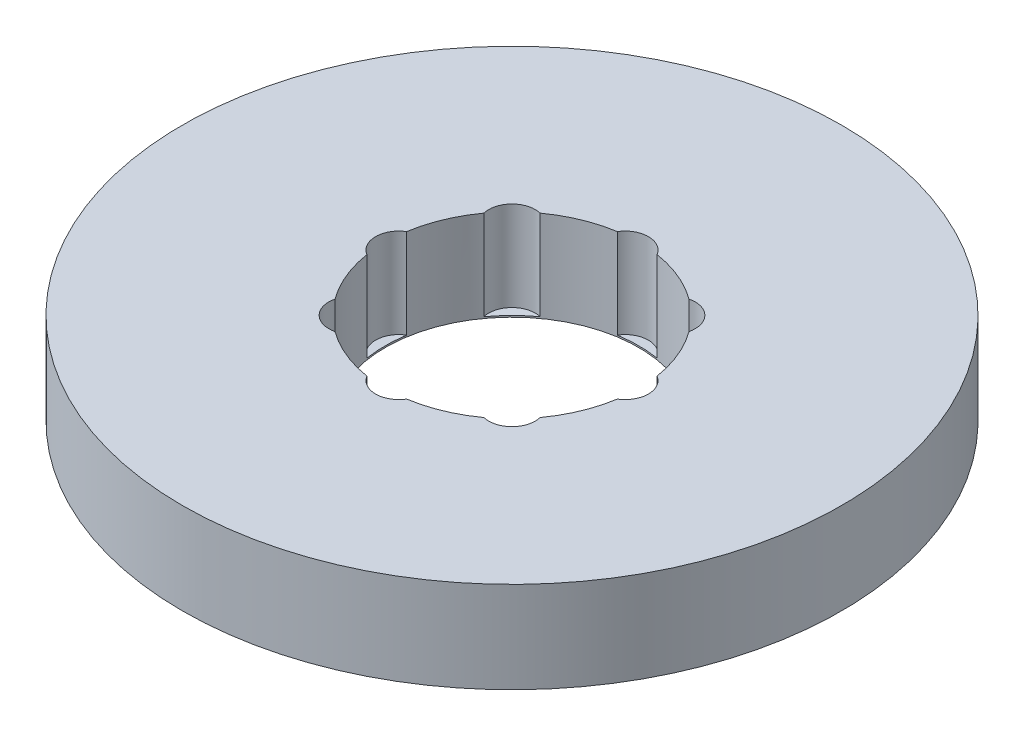
ISO-10303-21;
HEADER;
FILE_DESCRIPTION(('STEP AP214'),'2;1');
FILE_NAME('part.step','',(''),(''),'','','');
FILE_SCHEMA(('AUTOMOTIVE_DESIGN { 1 0 10303 214 1 1 1 1 }'));
ENDSEC;
DATA;
#1=APPLICATION_CONTEXT('core data for automotive mechanical design processes');
#2=APPLICATION_PROTOCOL_DEFINITION('international standard','automotive_design',2000,#1);
#3=PRODUCT_CONTEXT('',#1,'mechanical');
#4=PRODUCT('Part','Part','',(#3));
#5=PRODUCT_RELATED_PRODUCT_CATEGORY('part','',(#4));
#6=PRODUCT_DEFINITION_FORMATION('','',#4);
#7=PRODUCT_DEFINITION_CONTEXT('part definition',#1,'design');
#8=PRODUCT_DEFINITION('design','',#6,#7);
#9=PRODUCT_DEFINITION_SHAPE('','',#8);
#10=(LENGTH_UNIT() NAMED_UNIT(*) SI_UNIT(.MILLI.,.METRE.));
#11=(NAMED_UNIT(*) PLANE_ANGLE_UNIT() SI_UNIT($,.RADIAN.));
#12=(NAMED_UNIT(*) SI_UNIT($,.STERADIAN.) SOLID_ANGLE_UNIT());
#13=UNCERTAINTY_MEASURE_WITH_UNIT(LENGTH_MEASURE(1.E-05),#10,'distance_accuracy_value','');
#14=(GEOMETRIC_REPRESENTATION_CONTEXT(3) GLOBAL_UNCERTAINTY_ASSIGNED_CONTEXT((#13)) GLOBAL_UNIT_ASSIGNED_CONTEXT((#10,
#11,#12)) REPRESENTATION_CONTEXT('',''));
#15=CARTESIAN_POINT('',(0.,0.,0.));
#16=DIRECTION('',(0.,0.,1.));
#17=DIRECTION('',(1.,0.,0.));
#18=AXIS2_PLACEMENT_3D('',#15,#16,#17);
#19=CARTESIAN_POINT('',(0.,9.,0.));
#20=DIRECTION('',(0.,-1.,0.));
#21=DIRECTION('',(0.,0.,-1.));
#22=AXIS2_PLACEMENT_3D('',#19,#20,#21);
#23=CYLINDRICAL_SURFACE('',#22,32.5);
#24=CARTESIAN_POINT('',(0.,9.,0.));
#25=DIRECTION('',(0.,1.,0.));
#26=DIRECTION('',(0.,0.,1.));
#27=AXIS2_PLACEMENT_3D('',#24,#25,#26);
#28=CIRCLE('',#27,32.5);
#29=CARTESIAN_POINT('',(0.,9.,32.5));
#30=VERTEX_POINT('',#29);
#31=EDGE_CURVE('E183',#30,#30,#28,.T.);
#32=ORIENTED_EDGE('',*,*,#31,.F.);
#33=EDGE_LOOP('',(#32));
#34=FACE_BOUND('',#33,.T.);
#35=CARTESIAN_POINT('',(0.,0.,0.));
#36=DIRECTION('',(0.,1.,0.));
#37=DIRECTION('',(0.,0.,1.));
#38=AXIS2_PLACEMENT_3D('',#35,#36,#37);
#39=CIRCLE('',#38,32.5);
#40=CARTESIAN_POINT('',(0.,0.,32.5));
#41=VERTEX_POINT('',#40);
#42=EDGE_CURVE('E182',#41,#41,#39,.T.);
#43=ORIENTED_EDGE('',*,*,#42,.T.);
#44=EDGE_LOOP('',(#43));
#45=FACE_BOUND('',#44,.T.);
#46=ADVANCED_FACE('F39',(#34,#45),#23,.T.);
#47=CARTESIAN_POINT('',(0.,9.,0.));
#48=DIRECTION('',(0.,1.,0.));
#49=DIRECTION('',(0.,0.,1.));
#50=AXIS2_PLACEMENT_3D('',#47,#48,#49);
#51=PLANE('',#50);
#52=CARTESIAN_POINT('',(0.,9.,11.1549653682034));
#53=DIRECTION('',(0.,1.,0.));
#54=DIRECTION('',(1.,0.,0.));
#55=AXIS2_PLACEMENT_3D('',#52,#53,#54);
#56=CIRCLE('',#55,2.29332355771924);
#57=CARTESIAN_POINT('',(-1.9601825579332,9.,12.3453507175606));
#58=VERTEX_POINT('',#57);
#59=CARTESIAN_POINT('',(1.96018255793328,9.,12.3453507175606));
#60=VERTEX_POINT('',#59);
#61=EDGE_CURVE('E256',#58,#60,#56,.T.);
#62=ORIENTED_EDGE('',*,*,#61,.F.);
#63=CARTESIAN_POINT('',(0.,9.,0.));
#64=DIRECTION('',(0.,1.,0.));
#65=DIRECTION('',(0.,0.,1.));
#66=AXIS2_PLACEMENT_3D('',#63,#64,#65);
#67=CIRCLE('',#66,12.5);
#68=CARTESIAN_POINT('',(-7.34342282943511,9.,10.1155395875915));
#69=VERTEX_POINT('',#68);
#70=EDGE_CURVE('E175',#69,#58,#67,.T.);
#71=ORIENTED_EDGE('',*,*,#70,.F.);
#72=CARTESIAN_POINT('',(-7.88775165575769,9.,7.88775165575772));
#73=DIRECTION('',(0.,1.,0.));
#74=DIRECTION('',(0.707106781186549,0.,0.707106781186546));
#75=AXIS2_PLACEMENT_3D('',#72,#73,#74);
#76=CIRCLE('',#75,2.29332355771924);
#77=CARTESIAN_POINT('',(-10.1155395875915,9.,7.34342282943515));
#78=VERTEX_POINT('',#77);
#79=EDGE_CURVE('E152',#78,#69,#76,.T.);
#80=ORIENTED_EDGE('',*,*,#79,.F.);
#81=CARTESIAN_POINT('',(-12.3453507175606,9.,1.96018255793324));
#82=VERTEX_POINT('',#81);
#83=EDGE_CURVE('E168',#82,#78,#67,.T.);
#84=ORIENTED_EDGE('',*,*,#83,.F.);
#85=CARTESIAN_POINT('',(-11.1549653682034,9.,0.));
#86=DIRECTION('',(0.,1.,0.));
#87=DIRECTION('',(0.,0.,1.));
#88=AXIS2_PLACEMENT_3D('',#85,#86,#87);
#89=CIRCLE('',#88,2.29332355771924);
#90=CARTESIAN_POINT('',(-12.3453507175606,9.,-1.96018255793324));
#91=VERTEX_POINT('',#90);
#92=EDGE_CURVE('E205',#91,#82,#89,.T.);
#93=ORIENTED_EDGE('',*,*,#92,.F.);
#94=CARTESIAN_POINT('',(-10.1155395875916,9.,-7.34342282943501));
#95=VERTEX_POINT('',#94);
#96=EDGE_CURVE('E181',#95,#91,#67,.T.);
#97=ORIENTED_EDGE('',*,*,#96,.F.);
#98=CARTESIAN_POINT('',(-7.8877516557578,9.,-7.88775165575761));
#99=DIRECTION('',(0.,1.,0.));
#100=DIRECTION('',(-0.707106781186539,0.,0.707106781186556));
#101=AXIS2_PLACEMENT_3D('',#98,#99,#100);
#102=CIRCLE('',#101,2.29332355771924);
#103=CARTESIAN_POINT('',(-7.34342282943525,9.,-10.1155395875914));
#104=VERTEX_POINT('',#103);
#105=EDGE_CURVE('E453',#104,#95,#102,.T.);
#106=ORIENTED_EDGE('',*,*,#105,.F.);
#107=CARTESIAN_POINT('',(-1.96018255793337,9.,-12.3453507175606));
#108=VERTEX_POINT('',#107);
#109=EDGE_CURVE('E189',#108,#104,#67,.T.);
#110=ORIENTED_EDGE('',*,*,#109,.F.);
#111=CARTESIAN_POINT('',(-1.16842060255571E-13,9.,-11.1549653682034));
#112=DIRECTION('',(0.,1.,0.));
#113=DIRECTION('',(-1.,0.,0.));
#114=AXIS2_PLACEMENT_3D('',#111,#112,#113);
#115=CIRCLE('',#114,2.29332355771924);
#116=CARTESIAN_POINT('',(1.96018255793311,9.,-12.3453507175606));
#117=VERTEX_POINT('',#116);
#118=EDGE_CURVE('E462',#117,#108,#115,.T.);
#119=ORIENTED_EDGE('',*,*,#118,.F.);
#120=CARTESIAN_POINT('',(7.34342282943504,9.,-10.1155395875916));
#121=VERTEX_POINT('',#120);
#122=EDGE_CURVE('E197',#121,#117,#67,.T.);
#123=ORIENTED_EDGE('',*,*,#122,.F.);
#124=CARTESIAN_POINT('',(7.88775165575764,9.,-7.88775165575778));
#125=DIRECTION('',(0.,1.,0.));
#126=DIRECTION('',(-0.707106781186554,0.,-0.707106781186541));
#127=AXIS2_PLACEMENT_3D('',#124,#125,#126);
#128=CIRCLE('',#127,2.29332355771924);
#129=CARTESIAN_POINT('',(10.1155395875914,9.,-7.34342282943522));
#130=VERTEX_POINT('',#129);
#131=EDGE_CURVE('E470',#130,#121,#128,.T.);
#132=ORIENTED_EDGE('',*,*,#131,.F.);
#133=CARTESIAN_POINT('',(12.3453507175606,9.,-1.96018255793324));
#134=VERTEX_POINT('',#133);
#135=EDGE_CURVE('E489',#134,#130,#67,.T.);
#136=ORIENTED_EDGE('',*,*,#135,.F.);
#137=CARTESIAN_POINT('',(11.1549653682034,9.,0.));
#138=DIRECTION('',(0.,1.,0.));
#139=DIRECTION('',(0.,0.,-1.));
#140=AXIS2_PLACEMENT_3D('',#137,#138,#139);
#141=CIRCLE('',#140,2.29332355771924);
#142=CARTESIAN_POINT('',(12.3453507175606,9.,1.96018255793324));
#143=VERTEX_POINT('',#142);
#144=EDGE_CURVE('E476',#143,#134,#141,.T.);
#145=ORIENTED_EDGE('',*,*,#144,.F.);
#146=CARTESIAN_POINT('',(10.1155395875915,9.,7.34342282943508));
#147=VERTEX_POINT('',#146);
#148=EDGE_CURVE('E491',#147,#143,#67,.T.);
#149=ORIENTED_EDGE('',*,*,#148,.F.);
#150=CARTESIAN_POINT('',(7.88775165575775,9.,7.88775165575767));
#151=DIRECTION('',(0.,1.,0.));
#152=DIRECTION('',(0.707106781186544,0.,-0.707106781186551));
#153=AXIS2_PLACEMENT_3D('',#150,#151,#152);
#154=CIRCLE('',#153,2.29332355771924);
#155=CARTESIAN_POINT('',(7.34342282943519,9.,10.1155395875915));
#156=VERTEX_POINT('',#155);
#157=EDGE_CURVE('E475',#156,#147,#154,.T.);
#158=ORIENTED_EDGE('',*,*,#157,.F.);
#159=EDGE_CURVE('E190',#60,#156,#67,.T.);
#160=ORIENTED_EDGE('',*,*,#159,.F.);
#161=EDGE_LOOP('',(#62,#71,#80,#84,#93,#97,#106,#110,#119,#123,#132,#136,#145,#149,#158,#160));
#162=FACE_BOUND('',#161,.T.);
#163=ORIENTED_EDGE('',*,*,#31,.T.);
#164=EDGE_LOOP('',(#163));
#165=FACE_BOUND('',#164,.T.);
#166=ADVANCED_FACE('F170',(#162,#165),#51,.T.);
#167=CARTESIAN_POINT('',(0.,0.,0.));
#168=DIRECTION('',(0.,1.,0.));
#169=DIRECTION('',(0.,0.,1.));
#170=AXIS2_PLACEMENT_3D('',#167,#168,#169);
#171=PLANE('',#170);
#172=CARTESIAN_POINT('',(0.,0.,0.));
#173=DIRECTION('',(0.,1.,0.));
#174=DIRECTION('',(0.,0.,1.));
#175=AXIS2_PLACEMENT_3D('',#172,#173,#174);
#176=CIRCLE('',#175,12.5);
#177=CARTESIAN_POINT('',(0.,0.,12.5));
#178=VERTEX_POINT('',#177);
#179=EDGE_CURVE('E191',#178,#178,#176,.T.);
#180=ORIENTED_EDGE('',*,*,#179,.T.);
#181=EDGE_LOOP('',(#180));
#182=FACE_BOUND('',#181,.T.);
#183=ORIENTED_EDGE('',*,*,#42,.F.);
#184=EDGE_LOOP('',(#183));
#185=FACE_BOUND('',#184,.T.);
#186=ADVANCED_FACE('F277',(#182,#185),#171,.F.);
#187=CARTESIAN_POINT('',(0.,9.,0.));
#188=DIRECTION('',(0.,-1.,0.));
#189=DIRECTION('',(0.,0.,-1.));
#190=AXIS2_PLACEMENT_3D('',#187,#188,#189);
#191=CYLINDRICAL_SURFACE('',#190,12.5);
#192=DIRECTION('',(0.,1.,0.));
#193=VECTOR('',#192,1.);
#194=CARTESIAN_POINT('',(-1.9601825579332,4.57739685609202,12.3453507175606));
#195=LINE('',#194,#193);
#196=CARTESIAN_POINT('',(-1.9601825579332,0.154793712184052,12.3453507175606));
#197=VERTEX_POINT('',#196);
#198=EDGE_CURVE('E11',#197,#58,#195,.T.);
#199=ORIENTED_EDGE('',*,*,#198,.F.);
#200=CARTESIAN_POINT('',(0.,0.154793712184052,0.));
#201=DIRECTION('',(0.,1.,0.));
#202=DIRECTION('',(0.,0.,1.));
#203=AXIS2_PLACEMENT_3D('',#200,#201,#202);
#204=CIRCLE('',#203,12.5);
#205=CARTESIAN_POINT('',(1.96018255793328,0.154793712184052,12.3453507175606));
#206=VERTEX_POINT('',#205);
#207=EDGE_CURVE('E251',#197,#206,#204,.T.);
#208=ORIENTED_EDGE('',*,*,#207,.T.);
#209=DIRECTION('',(0.,1.,0.));
#210=VECTOR('',#209,1.);
#211=CARTESIAN_POINT('',(1.96018255793328,4.57739685609202,12.3453507175606));
#212=LINE('',#211,#210);
#213=EDGE_CURVE('E46',#60,#206,#212,.F.);
#214=ORIENTED_EDGE('',*,*,#213,.F.);
#215=ORIENTED_EDGE('',*,*,#159,.T.);
#216=DIRECTION('',(0.,1.,0.));
#217=VECTOR('',#216,1.);
#218=CARTESIAN_POINT('',(7.34342282943518,4.57739685609202,10.1155395875915));
#219=LINE('',#218,#217);
#220=CARTESIAN_POINT('',(7.34342282943519,0.154793712184052,10.1155395875915));
#221=VERTEX_POINT('',#220);
#222=EDGE_CURVE('E253',#221,#156,#219,.T.);
#223=ORIENTED_EDGE('',*,*,#222,.F.);
#224=CARTESIAN_POINT('',(0.,0.154793712184052,0.));
#225=DIRECTION('',(0.,1.,0.));
#226=DIRECTION('',(0.,0.,1.));
#227=AXIS2_PLACEMENT_3D('',#224,#225,#226);
#228=CIRCLE('',#227,12.5);
#229=CARTESIAN_POINT('',(10.1155395875915,0.154793712184052,7.34342282943508));
#230=VERTEX_POINT('',#229);
#231=EDGE_CURVE('E246',#221,#230,#228,.T.);
#232=ORIENTED_EDGE('',*,*,#231,.T.);
#233=DIRECTION('',(0.,1.,0.));
#234=VECTOR('',#233,1.);
#235=CARTESIAN_POINT('',(10.1155395875915,4.57739685609202,7.34342282943508));
#236=LINE('',#235,#234);
#237=EDGE_CURVE('E248',#147,#230,#236,.F.);
#238=ORIENTED_EDGE('',*,*,#237,.F.);
#239=ORIENTED_EDGE('',*,*,#148,.T.);
#240=DIRECTION('',(0.,1.,0.));
#241=VECTOR('',#240,1.);
#242=CARTESIAN_POINT('',(12.3453507175606,4.57739685609202,1.96018255793324));
#243=LINE('',#242,#241);
#244=CARTESIAN_POINT('',(12.3453507175606,0.154793712184052,1.96018255793324));
#245=VERTEX_POINT('',#244);
#246=EDGE_CURVE('E243',#245,#143,#243,.T.);
#247=ORIENTED_EDGE('',*,*,#246,.F.);
#248=CARTESIAN_POINT('',(0.,0.154793712184052,0.));
#249=DIRECTION('',(0.,1.,0.));
#250=DIRECTION('',(0.,0.,1.));
#251=AXIS2_PLACEMENT_3D('',#248,#249,#250);
#252=CIRCLE('',#251,12.5);
#253=CARTESIAN_POINT('',(12.3453507175606,0.154793712184052,-1.96018255793324));
#254=VERTEX_POINT('',#253);
#255=EDGE_CURVE('E236',#245,#254,#252,.T.);
#256=ORIENTED_EDGE('',*,*,#255,.T.);
#257=DIRECTION('',(0.,1.,0.));
#258=VECTOR('',#257,1.);
#259=CARTESIAN_POINT('',(12.3453507175606,4.57739685609202,-1.96018255793324));
#260=LINE('',#259,#258);
#261=EDGE_CURVE('E241',#134,#254,#260,.F.);
#262=ORIENTED_EDGE('',*,*,#261,.F.);
#263=ORIENTED_EDGE('',*,*,#135,.T.);
#264=DIRECTION('',(0.,1.,0.));
#265=VECTOR('',#264,1.);
#266=CARTESIAN_POINT('',(10.1155395875914,4.57739685609202,-7.34342282943522));
#267=LINE('',#266,#265);
#268=CARTESIAN_POINT('',(10.1155395875914,0.154793712184052,-7.34342282943522));
#269=VERTEX_POINT('',#268);
#270=EDGE_CURVE('E237',#269,#130,#267,.T.);
#271=ORIENTED_EDGE('',*,*,#270,.F.);
#272=CARTESIAN_POINT('',(0.,0.154793712184052,0.));
#273=DIRECTION('',(0.,1.,0.));
#274=DIRECTION('',(0.,0.,1.));
#275=AXIS2_PLACEMENT_3D('',#272,#273,#274);
#276=CIRCLE('',#275,12.5);
#277=CARTESIAN_POINT('',(7.34342282943504,0.154793712184052,-10.1155395875916));
#278=VERTEX_POINT('',#277);
#279=EDGE_CURVE('E229',#269,#278,#276,.T.);
#280=ORIENTED_EDGE('',*,*,#279,.T.);
#281=DIRECTION('',(0.,1.,0.));
#282=VECTOR('',#281,1.);
#283=CARTESIAN_POINT('',(7.34342282943504,4.57739685609202,-10.1155395875916));
#284=LINE('',#283,#282);
#285=EDGE_CURVE('E232',#121,#278,#284,.F.);
#286=ORIENTED_EDGE('',*,*,#285,.F.);
#287=ORIENTED_EDGE('',*,*,#122,.T.);
#288=DIRECTION('',(0.,1.,0.));
#289=VECTOR('',#288,1.);
#290=CARTESIAN_POINT('',(1.96018255793311,4.57739685609202,-12.3453507175606));
#291=LINE('',#290,#289);
#292=CARTESIAN_POINT('',(1.96018255793311,0.154793712184052,-12.3453507175606));
#293=VERTEX_POINT('',#292);
#294=EDGE_CURVE('E227',#293,#117,#291,.T.);
#295=ORIENTED_EDGE('',*,*,#294,.F.);
#296=CARTESIAN_POINT('',(0.,0.154793712184052,0.));
#297=DIRECTION('',(0.,1.,0.));
#298=DIRECTION('',(0.,0.,1.));
#299=AXIS2_PLACEMENT_3D('',#296,#297,#298);
#300=CIRCLE('',#299,12.5);
#301=CARTESIAN_POINT('',(-1.96018255793337,0.154793712184052,-12.3453507175606));
#302=VERTEX_POINT('',#301);
#303=EDGE_CURVE('E225',#293,#302,#300,.T.);
#304=ORIENTED_EDGE('',*,*,#303,.T.);
#305=DIRECTION('',(0.,1.,0.));
#306=VECTOR('',#305,1.);
#307=CARTESIAN_POINT('',(-1.96018255793337,4.57739685609202,-12.3453507175606));
#308=LINE('',#307,#306);
#309=EDGE_CURVE('E223',#108,#302,#308,.F.);
#310=ORIENTED_EDGE('',*,*,#309,.F.);
#311=ORIENTED_EDGE('',*,*,#109,.T.);
#312=DIRECTION('',(0.,1.,0.));
#313=VECTOR('',#312,1.);
#314=CARTESIAN_POINT('',(-7.34342282943525,4.57739685609202,-10.1155395875914));
#315=LINE('',#314,#313);
#316=CARTESIAN_POINT('',(-7.34342282943525,0.154793712184052,-10.1155395875914));
#317=VERTEX_POINT('',#316);
#318=EDGE_CURVE('E219',#317,#104,#315,.T.);
#319=ORIENTED_EDGE('',*,*,#318,.F.);
#320=CARTESIAN_POINT('',(0.,0.154793712184052,0.));
#321=DIRECTION('',(0.,1.,0.));
#322=DIRECTION('',(0.,0.,1.));
#323=AXIS2_PLACEMENT_3D('',#320,#321,#322);
#324=CIRCLE('',#323,12.5);
#325=CARTESIAN_POINT('',(-10.1155395875916,0.154793712184052,-7.34342282943501));
#326=VERTEX_POINT('',#325);
#327=EDGE_CURVE('E159',#317,#326,#324,.T.);
#328=ORIENTED_EDGE('',*,*,#327,.T.);
#329=DIRECTION('',(0.,1.,0.));
#330=VECTOR('',#329,1.);
#331=CARTESIAN_POINT('',(-10.1155395875916,4.57739685609202,-7.34342282943501));
#332=LINE('',#331,#330);
#333=EDGE_CURVE('E220',#95,#326,#332,.F.);
#334=ORIENTED_EDGE('',*,*,#333,.F.);
#335=ORIENTED_EDGE('',*,*,#96,.T.);
#336=DIRECTION('',(0.,1.,0.));
#337=VECTOR('',#336,1.);
#338=CARTESIAN_POINT('',(-12.3453507175606,4.57739685609202,-1.96018255793324));
#339=LINE('',#338,#337);
#340=CARTESIAN_POINT('',(-12.3453507175606,0.154793712184052,-1.96018255793324));
#341=VERTEX_POINT('',#340);
#342=EDGE_CURVE('E209',#341,#91,#339,.T.);
#343=ORIENTED_EDGE('',*,*,#342,.F.);
#344=CARTESIAN_POINT('',(0.,0.154793712184052,0.));
#345=DIRECTION('',(0.,1.,0.));
#346=DIRECTION('',(0.,0.,1.));
#347=AXIS2_PLACEMENT_3D('',#344,#345,#346);
#348=CIRCLE('',#347,12.5);
#349=CARTESIAN_POINT('',(-12.3453507175606,0.154793712184052,1.96018255793324));
#350=VERTEX_POINT('',#349);
#351=EDGE_CURVE('E206',#341,#350,#348,.T.);
#352=ORIENTED_EDGE('',*,*,#351,.T.);
#353=DIRECTION('',(0.,1.,0.));
#354=VECTOR('',#353,1.);
#355=CARTESIAN_POINT('',(-12.3453507175606,4.57739685609202,1.96018255793324));
#356=LINE('',#355,#354);
#357=EDGE_CURVE('E179',#82,#350,#356,.F.);
#358=ORIENTED_EDGE('',*,*,#357,.F.);
#359=ORIENTED_EDGE('',*,*,#83,.T.);
#360=DIRECTION('',(0.,1.,0.));
#361=VECTOR('',#360,1.);
#362=CARTESIAN_POINT('',(-10.1155395875915,4.57739685609202,7.34342282943515));
#363=LINE('',#362,#361);
#364=CARTESIAN_POINT('',(-10.1155395875915,0.154793712184052,7.34342282943515));
#365=VERTEX_POINT('',#364);
#366=EDGE_CURVE('E147',#365,#78,#363,.T.);
#367=ORIENTED_EDGE('',*,*,#366,.F.);
#368=CARTESIAN_POINT('',(0.,0.154793712184052,0.));
#369=DIRECTION('',(0.,1.,0.));
#370=DIRECTION('',(0.,0.,1.));
#371=AXIS2_PLACEMENT_3D('',#368,#369,#370);
#372=CIRCLE('',#371,12.5);
#373=CARTESIAN_POINT('',(-7.34342282943511,0.154793712184052,10.1155395875915));
#374=VERTEX_POINT('',#373);
#375=EDGE_CURVE('E215',#365,#374,#372,.T.);
#376=ORIENTED_EDGE('',*,*,#375,.T.);
#377=DIRECTION('',(0.,1.,0.));
#378=VECTOR('',#377,1.);
#379=CARTESIAN_POINT('',(-7.34342282943511,4.57739685609202,10.1155395875915));
#380=LINE('',#379,#378);
#381=EDGE_CURVE('E161',#69,#374,#380,.F.);
#382=ORIENTED_EDGE('',*,*,#381,.F.);
#383=ORIENTED_EDGE('',*,*,#70,.T.);
#384=EDGE_LOOP('',(#199,#208,#214,#215,#223,#232,#238,#239,#247,#256,#262,#263,#271,#280,#286,
#287,#295,#304,#310,#311,#319,#328,#334,#335,#343,#352,#358,#359,#367,#376,#382,#383));
#385=FACE_BOUND('',#384,.T.);
#386=ORIENTED_EDGE('',*,*,#179,.F.);
#387=EDGE_LOOP('',(#386));
#388=FACE_BOUND('',#387,.T.);
#389=ADVANCED_FACE('F176',(#385,#388),#191,.F.);
#390=CARTESIAN_POINT('',(-11.1549653682034,0.154793712184052,0.));
#391=DIRECTION('',(0.,1.,0.));
#392=DIRECTION('',(0.,0.,1.));
#393=AXIS2_PLACEMENT_3D('',#390,#391,#392);
#394=CYLINDRICAL_SURFACE('',#393,2.29332355771924);
#395=ORIENTED_EDGE('',*,*,#342,.T.);
#396=ORIENTED_EDGE('',*,*,#92,.T.);
#397=ORIENTED_EDGE('',*,*,#357,.T.);
#398=CARTESIAN_POINT('',(-11.1549653682034,0.154793712184052,0.));
#399=DIRECTION('',(0.,1.,0.));
#400=DIRECTION('',(0.,0.,1.));
#401=AXIS2_PLACEMENT_3D('',#398,#399,#400);
#402=CIRCLE('',#401,2.29332355771924);
#403=EDGE_CURVE('E200',#341,#350,#402,.T.);
#404=ORIENTED_EDGE('',*,*,#403,.F.);
#405=EDGE_LOOP('',(#395,#396,#397,#404));
#406=FACE_BOUND('',#405,.T.);
#407=ADVANCED_FACE('F286',(#406),#394,.F.);
#408=CARTESIAN_POINT('',(-11.1549653682034,0.154793712184052,0.));
#409=DIRECTION('',(0.,1.,0.));
#410=DIRECTION('',(0.,0.,1.));
#411=AXIS2_PLACEMENT_3D('',#408,#409,#410);
#412=PLANE('',#411);
#413=ORIENTED_EDGE('',*,*,#403,.T.);
#414=ORIENTED_EDGE('',*,*,#351,.F.);
#415=EDGE_LOOP('',(#413,#414));
#416=FACE_BOUND('',#415,.T.);
#417=ADVANCED_FACE('F289',(#416),#412,.T.);
#418=CARTESIAN_POINT('',(-7.88775165575769,0.154793712184052,7.88775165575772));
#419=DIRECTION('',(0.,1.,0.));
#420=DIRECTION('',(0.,0.,1.));
#421=AXIS2_PLACEMENT_3D('',#418,#419,#420);
#422=CYLINDRICAL_SURFACE('',#421,2.29332355771924);
#423=ORIENTED_EDGE('',*,*,#366,.T.);
#424=ORIENTED_EDGE('',*,*,#79,.T.);
#425=ORIENTED_EDGE('',*,*,#381,.T.);
#426=CARTESIAN_POINT('',(-7.88775165575769,0.154793712184052,7.88775165575772));
#427=DIRECTION('',(0.,1.,0.));
#428=DIRECTION('',(0.707106781186549,0.,0.707106781186546));
#429=AXIS2_PLACEMENT_3D('',#426,#427,#428);
#430=CIRCLE('',#429,2.29332355771924);
#431=EDGE_CURVE('E156',#365,#374,#430,.T.);
#432=ORIENTED_EDGE('',*,*,#431,.F.);
#433=EDGE_LOOP('',(#423,#424,#425,#432));
#434=FACE_BOUND('',#433,.T.);
#435=ADVANCED_FACE('F155',(#434),#422,.F.);
#436=CARTESIAN_POINT('',(-7.88775165575769,0.154793712184052,7.88775165575772));
#437=DIRECTION('',(0.,1.,0.));
#438=DIRECTION('',(0.707106781186549,0.,0.707106781186546));
#439=AXIS2_PLACEMENT_3D('',#436,#437,#438);
#440=PLANE('',#439);
#441=ORIENTED_EDGE('',*,*,#431,.T.);
#442=ORIENTED_EDGE('',*,*,#375,.F.);
#443=EDGE_LOOP('',(#441,#442));
#444=FACE_BOUND('',#443,.T.);
#445=ADVANCED_FACE('F300',(#444),#440,.T.);
#446=CARTESIAN_POINT('',(-7.8877516557578,0.154793712184052,-7.88775165575761));
#447=DIRECTION('',(0.,1.,0.));
#448=DIRECTION('',(0.,0.,1.));
#449=AXIS2_PLACEMENT_3D('',#446,#447,#448);
#450=CYLINDRICAL_SURFACE('',#449,2.29332355771924);
#451=ORIENTED_EDGE('',*,*,#318,.T.);
#452=ORIENTED_EDGE('',*,*,#105,.T.);
#453=ORIENTED_EDGE('',*,*,#333,.T.);
#454=CARTESIAN_POINT('',(-7.8877516557578,0.154793712184052,-7.88775165575761));
#455=DIRECTION('',(0.,1.,0.));
#456=DIRECTION('',(-0.707106781186539,0.,0.707106781186556));
#457=AXIS2_PLACEMENT_3D('',#454,#455,#456);
#458=CIRCLE('',#457,2.29332355771924);
#459=EDGE_CURVE('E454',#317,#326,#458,.T.);
#460=ORIENTED_EDGE('',*,*,#459,.F.);
#461=EDGE_LOOP('',(#451,#452,#453,#460));
#462=FACE_BOUND('',#461,.T.);
#463=ADVANCED_FACE('F299',(#462),#450,.F.);
#464=CARTESIAN_POINT('',(-7.8877516557578,0.154793712184052,-7.88775165575761));
#465=DIRECTION('',(0.,1.,0.));
#466=DIRECTION('',(-0.707106781186539,0.,0.707106781186556));
#467=AXIS2_PLACEMENT_3D('',#464,#465,#466);
#468=PLANE('',#467);
#469=ORIENTED_EDGE('',*,*,#459,.T.);
#470=ORIENTED_EDGE('',*,*,#327,.F.);
#471=EDGE_LOOP('',(#469,#470));
#472=FACE_BOUND('',#471,.T.);
#473=ADVANCED_FACE('F379',(#472),#468,.T.);
#474=CARTESIAN_POINT('',(-1.16842060255571E-13,0.154793712184052,-11.1549653682034));
#475=DIRECTION('',(0.,1.,0.));
#476=DIRECTION('',(0.,0.,1.));
#477=AXIS2_PLACEMENT_3D('',#474,#475,#476);
#478=CYLINDRICAL_SURFACE('',#477,2.29332355771924);
#479=ORIENTED_EDGE('',*,*,#294,.T.);
#480=ORIENTED_EDGE('',*,*,#118,.T.);
#481=ORIENTED_EDGE('',*,*,#309,.T.);
#482=CARTESIAN_POINT('',(-1.16842060255571E-13,0.154793712184052,-11.1549653682034));
#483=DIRECTION('',(0.,1.,0.));
#484=DIRECTION('',(-1.,0.,0.));
#485=AXIS2_PLACEMENT_3D('',#482,#483,#484);
#486=CIRCLE('',#485,2.29332355771924);
#487=EDGE_CURVE('E465',#293,#302,#486,.T.);
#488=ORIENTED_EDGE('',*,*,#487,.F.);
#489=EDGE_LOOP('',(#479,#480,#481,#488));
#490=FACE_BOUND('',#489,.T.);
#491=ADVANCED_FACE('F371',(#490),#478,.F.);
#492=CARTESIAN_POINT('',(-1.16842060255571E-13,0.154793712184052,-11.1549653682034));
#493=DIRECTION('',(0.,1.,0.));
#494=DIRECTION('',(-1.,0.,0.));
#495=AXIS2_PLACEMENT_3D('',#492,#493,#494);
#496=PLANE('',#495);
#497=ORIENTED_EDGE('',*,*,#487,.T.);
#498=ORIENTED_EDGE('',*,*,#303,.F.);
#499=EDGE_LOOP('',(#497,#498));
#500=FACE_BOUND('',#499,.T.);
#501=ADVANCED_FACE('F308',(#500),#496,.T.);
#502=CARTESIAN_POINT('',(7.88775165575764,0.154793712184052,-7.88775165575778));
#503=DIRECTION('',(0.,1.,0.));
#504=DIRECTION('',(0.,0.,1.));
#505=AXIS2_PLACEMENT_3D('',#502,#503,#504);
#506=CYLINDRICAL_SURFACE('',#505,2.29332355771924);
#507=ORIENTED_EDGE('',*,*,#270,.T.);
#508=ORIENTED_EDGE('',*,*,#131,.T.);
#509=ORIENTED_EDGE('',*,*,#285,.T.);
#510=CARTESIAN_POINT('',(7.88775165575764,0.154793712184052,-7.88775165575778));
#511=DIRECTION('',(0.,1.,0.));
#512=DIRECTION('',(-0.707106781186554,0.,-0.707106781186541));
#513=AXIS2_PLACEMENT_3D('',#510,#511,#512);
#514=CIRCLE('',#513,2.29332355771924);
#515=EDGE_CURVE('E477',#269,#278,#514,.T.);
#516=ORIENTED_EDGE('',*,*,#515,.F.);
#517=EDGE_LOOP('',(#507,#508,#509,#516));
#518=FACE_BOUND('',#517,.T.);
#519=ADVANCED_FACE('F305',(#518),#506,.F.);
#520=CARTESIAN_POINT('',(7.88775165575764,0.154793712184052,-7.88775165575778));
#521=DIRECTION('',(0.,1.,0.));
#522=DIRECTION('',(-0.707106781186554,0.,-0.707106781186541));
#523=AXIS2_PLACEMENT_3D('',#520,#521,#522);
#524=PLANE('',#523);
#525=ORIENTED_EDGE('',*,*,#515,.T.);
#526=ORIENTED_EDGE('',*,*,#279,.F.);
#527=EDGE_LOOP('',(#525,#526));
#528=FACE_BOUND('',#527,.T.);
#529=ADVANCED_FACE('F304',(#528),#524,.T.);
#530=CARTESIAN_POINT('',(11.1549653682034,0.154793712184052,0.));
#531=DIRECTION('',(0.,1.,0.));
#532=DIRECTION('',(0.,0.,1.));
#533=AXIS2_PLACEMENT_3D('',#530,#531,#532);
#534=CYLINDRICAL_SURFACE('',#533,2.29332355771924);
#535=ORIENTED_EDGE('',*,*,#246,.T.);
#536=ORIENTED_EDGE('',*,*,#144,.T.);
#537=ORIENTED_EDGE('',*,*,#261,.T.);
#538=CARTESIAN_POINT('',(11.1549653682034,0.154793712184052,0.));
#539=DIRECTION('',(0.,1.,0.));
#540=DIRECTION('',(0.,0.,-1.));
#541=AXIS2_PLACEMENT_3D('',#538,#539,#540);
#542=CIRCLE('',#541,2.29332355771924);
#543=EDGE_CURVE('E478',#245,#254,#542,.T.);
#544=ORIENTED_EDGE('',*,*,#543,.F.);
#545=EDGE_LOOP('',(#535,#536,#537,#544));
#546=FACE_BOUND('',#545,.T.);
#547=ADVANCED_FACE('F309',(#546),#534,.F.);
#548=CARTESIAN_POINT('',(11.1549653682034,0.154793712184052,0.));
#549=DIRECTION('',(0.,1.,0.));
#550=DIRECTION('',(0.,0.,-1.));
#551=AXIS2_PLACEMENT_3D('',#548,#549,#550);
#552=PLANE('',#551);
#553=ORIENTED_EDGE('',*,*,#543,.T.);
#554=ORIENTED_EDGE('',*,*,#255,.F.);
#555=EDGE_LOOP('',(#553,#554));
#556=FACE_BOUND('',#555,.T.);
#557=ADVANCED_FACE('F314',(#556),#552,.T.);
#558=CARTESIAN_POINT('',(7.88775165575775,0.154793712184052,7.88775165575767));
#559=DIRECTION('',(0.,1.,0.));
#560=DIRECTION('',(0.,0.,1.));
#561=AXIS2_PLACEMENT_3D('',#558,#559,#560);
#562=CYLINDRICAL_SURFACE('',#561,2.29332355771924);
#563=ORIENTED_EDGE('',*,*,#222,.T.);
#564=ORIENTED_EDGE('',*,*,#157,.T.);
#565=ORIENTED_EDGE('',*,*,#237,.T.);
#566=CARTESIAN_POINT('',(7.88775165575775,0.154793712184052,7.88775165575767));
#567=DIRECTION('',(0.,1.,0.));
#568=DIRECTION('',(0.707106781186544,0.,-0.707106781186551));
#569=AXIS2_PLACEMENT_3D('',#566,#567,#568);
#570=CIRCLE('',#569,2.29332355771924);
#571=EDGE_CURVE('E56',#221,#230,#570,.T.);
#572=ORIENTED_EDGE('',*,*,#571,.F.);
#573=EDGE_LOOP('',(#563,#564,#565,#572));
#574=FACE_BOUND('',#573,.T.);
#575=ADVANCED_FACE('F318',(#574),#562,.F.);
#576=CARTESIAN_POINT('',(7.88775165575775,0.154793712184052,7.88775165575767));
#577=DIRECTION('',(0.,1.,0.));
#578=DIRECTION('',(0.707106781186544,0.,-0.707106781186551));
#579=AXIS2_PLACEMENT_3D('',#576,#577,#578);
#580=PLANE('',#579);
#581=ORIENTED_EDGE('',*,*,#571,.T.);
#582=ORIENTED_EDGE('',*,*,#231,.F.);
#583=EDGE_LOOP('',(#581,#582));
#584=FACE_BOUND('',#583,.T.);
#585=ADVANCED_FACE('F270',(#584),#580,.T.);
#586=CARTESIAN_POINT('',(0.,0.154793712184052,11.1549653682034));
#587=DIRECTION('',(0.,1.,0.));
#588=DIRECTION('',(0.,0.,1.));
#589=AXIS2_PLACEMENT_3D('',#586,#587,#588);
#590=CYLINDRICAL_SURFACE('',#589,2.29332355771924);
#591=ORIENTED_EDGE('',*,*,#198,.T.);
#592=ORIENTED_EDGE('',*,*,#61,.T.);
#593=ORIENTED_EDGE('',*,*,#213,.T.);
#594=CARTESIAN_POINT('',(0.,0.154793712184052,11.1549653682034));
#595=DIRECTION('',(0.,1.,0.));
#596=DIRECTION('',(1.,0.,0.));
#597=AXIS2_PLACEMENT_3D('',#594,#595,#596);
#598=CIRCLE('',#597,2.29332355771924);
#599=EDGE_CURVE('E55',#197,#206,#598,.T.);
#600=ORIENTED_EDGE('',*,*,#599,.F.);
#601=EDGE_LOOP('',(#591,#592,#593,#600));
#602=FACE_BOUND('',#601,.T.);
#603=ADVANCED_FACE('F260',(#602),#590,.F.);
#604=CARTESIAN_POINT('',(0.,0.154793712184052,11.1549653682034));
#605=DIRECTION('',(0.,1.,0.));
#606=DIRECTION('',(1.,0.,0.));
#607=AXIS2_PLACEMENT_3D('',#604,#605,#606);
#608=PLANE('',#607);
#609=ORIENTED_EDGE('',*,*,#599,.T.);
#610=ORIENTED_EDGE('',*,*,#207,.F.);
#611=EDGE_LOOP('',(#609,#610));
#612=FACE_BOUND('',#611,.T.);
#613=ADVANCED_FACE('F261',(#612),#608,.T.);
#614=CLOSED_SHELL('',(#46,#166,#186,#389,#407,#417,#435,#445,#463,#473,#491,#501,#519,#529,#547,
#557,#575,#585,#603,#613));
#615=MANIFOLD_SOLID_BREP('B2',#614);
#616=ADVANCED_BREP_SHAPE_REPRESENTATION('',(#18,#615),#14);
#617=SHAPE_DEFINITION_REPRESENTATION(#9,#616);
ENDSEC;
END-ISO-10303-21;
